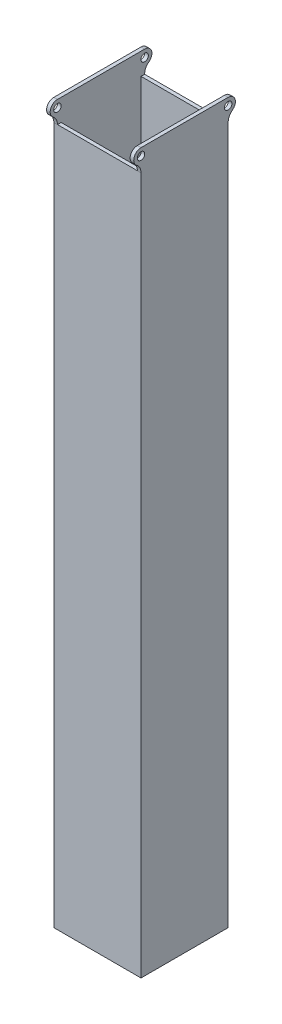
ISO-10303-21;
HEADER;
FILE_DESCRIPTION(('STEP AP214'),'2;1');
FILE_NAME('part.step','',(''),(''),'','','');
FILE_SCHEMA(('AUTOMOTIVE_DESIGN { 1 0 10303 214 1 1 1 1 }'));
ENDSEC;
DATA;
#1=APPLICATION_CONTEXT('core data for automotive mechanical design processes');
#2=APPLICATION_PROTOCOL_DEFINITION('international standard','automotive_design',2000,#1);
#3=PRODUCT_CONTEXT('',#1,'mechanical');
#4=PRODUCT('Part','Part','',(#3));
#5=PRODUCT_RELATED_PRODUCT_CATEGORY('part','',(#4));
#6=PRODUCT_DEFINITION_FORMATION('','',#4);
#7=PRODUCT_DEFINITION_CONTEXT('part definition',#1,'design');
#8=PRODUCT_DEFINITION('design','',#6,#7);
#9=PRODUCT_DEFINITION_SHAPE('','',#8);
#10=(LENGTH_UNIT() NAMED_UNIT(*) SI_UNIT(.MILLI.,.METRE.));
#11=(NAMED_UNIT(*) PLANE_ANGLE_UNIT() SI_UNIT($,.RADIAN.));
#12=(NAMED_UNIT(*) SI_UNIT($,.STERADIAN.) SOLID_ANGLE_UNIT());
#13=UNCERTAINTY_MEASURE_WITH_UNIT(LENGTH_MEASURE(1.E-05),#10,'distance_accuracy_value','');
#14=(GEOMETRIC_REPRESENTATION_CONTEXT(3) GLOBAL_UNCERTAINTY_ASSIGNED_CONTEXT((#13)) GLOBAL_UNIT_ASSIGNED_CONTEXT((#10,
#11,#12)) REPRESENTATION_CONTEXT('',''));
#15=CARTESIAN_POINT('',(0.,0.,0.));
#16=DIRECTION('',(0.,0.,1.));
#17=DIRECTION('',(1.,0.,0.));
#18=AXIS2_PLACEMENT_3D('',#15,#16,#17);
#19=CARTESIAN_POINT('',(0.,152.4,0.));
#20=DIRECTION('',(0.,-1.,0.));
#21=DIRECTION('',(0.,0.,-1.));
#22=AXIS2_PLACEMENT_3D('',#19,#20,#21);
#23=PLANE('',#22);
#24=DIRECTION('',(1.,0.,0.));
#25=VECTOR('',#24,1.);
#26=CARTESIAN_POINT('',(-19.05,152.4,19.05));
#27=LINE('',#26,#25);
#28=CARTESIAN_POINT('',(-17.4625,152.4,19.05));
#29=VERTEX_POINT('',#28);
#30=CARTESIAN_POINT('',(17.4625,152.4,19.05));
#31=VERTEX_POINT('',#30);
#32=EDGE_CURVE('E335',#29,#31,#27,.T.);
#33=ORIENTED_EDGE('',*,*,#32,.T.);
#34=DIRECTION('',(0.,0.,1.));
#35=VECTOR('',#34,1.);
#36=CARTESIAN_POINT('',(17.4625,152.4,19.05));
#37=LINE('',#36,#35);
#38=CARTESIAN_POINT('',(17.4625,152.4,17.4625));
#39=VERTEX_POINT('',#38);
#40=EDGE_CURVE('E253',#39,#31,#37,.T.);
#41=ORIENTED_EDGE('',*,*,#40,.F.);
#42=DIRECTION('',(1.,0.,0.));
#43=VECTOR('',#42,1.);
#44=CARTESIAN_POINT('',(0.,152.4,17.4625));
#45=LINE('',#44,#43);
#46=CARTESIAN_POINT('',(-17.4625,152.4,17.4625));
#47=VERTEX_POINT('',#46);
#48=EDGE_CURVE('E309',#47,#39,#45,.T.);
#49=ORIENTED_EDGE('',*,*,#48,.F.);
#50=DIRECTION('',(0.,0.,1.));
#51=VECTOR('',#50,1.);
#52=CARTESIAN_POINT('',(-17.4625,152.4,0.));
#53=LINE('',#52,#51);
#54=EDGE_CURVE('E12',#47,#29,#53,.T.);
#55=ORIENTED_EDGE('',*,*,#54,.T.);
#56=EDGE_LOOP('',(#33,#41,#49,#55));
#57=FACE_BOUND('',#56,.T.);
#58=ADVANCED_FACE('F86',(#57),#23,.F.);
#59=CARTESIAN_POINT('',(-19.05,152.4,19.05));
#60=DIRECTION('',(-1.,0.,0.));
#61=DIRECTION('',(0.,0.,1.));
#62=AXIS2_PLACEMENT_3D('',#59,#60,#61);
#63=PLANE('',#62);
#64=CARTESIAN_POINT('',(-19.05,158.75,-19.05));
#65=DIRECTION('',(-1.,0.,0.));
#66=DIRECTION('',(0.,0.,1.));
#67=AXIS2_PLACEMENT_3D('',#64,#65,#66);
#68=CIRCLE('',#67,1.63194999999999);
#69=CARTESIAN_POINT('',(-19.05,158.75,-17.41805));
#70=VERTEX_POINT('',#69);
#71=EDGE_CURVE('E700',#70,#70,#68,.T.);
#72=ORIENTED_EDGE('',*,*,#71,.F.);
#73=EDGE_LOOP('',(#72));
#74=FACE_BOUND('',#73,.T.);
#75=CARTESIAN_POINT('',(-19.05,158.75,19.05));
#76=DIRECTION('',(-1.,0.,0.));
#77=DIRECTION('',(0.,0.,1.));
#78=AXIS2_PLACEMENT_3D('',#75,#76,#77);
#79=CIRCLE('',#78,1.63194999999999);
#80=CARTESIAN_POINT('',(-19.05,158.75,20.68195));
#81=VERTEX_POINT('',#80);
#82=EDGE_CURVE('E704',#81,#81,#79,.T.);
#83=ORIENTED_EDGE('',*,*,#82,.F.);
#84=EDGE_LOOP('',(#83));
#85=FACE_BOUND('',#84,.T.);
#86=DIRECTION('',(0.,0.,-1.));
#87=VECTOR('',#86,1.);
#88=CARTESIAN_POINT('',(-19.05,-152.4,19.05));
#89=LINE('',#88,#87);
#90=CARTESIAN_POINT('',(-19.05,-152.4,19.05));
#91=VERTEX_POINT('',#90);
#92=CARTESIAN_POINT('',(-19.05,-152.4,-19.05));
#93=VERTEX_POINT('',#92);
#94=EDGE_CURVE('E325',#91,#93,#89,.T.);
#95=ORIENTED_EDGE('',*,*,#94,.F.);
#96=DIRECTION('',(0.,-1.,0.));
#97=VECTOR('',#96,1.);
#98=CARTESIAN_POINT('',(-19.05,152.4,19.05));
#99=LINE('',#98,#97);
#100=CARTESIAN_POINT('',(-19.05,152.4,19.05));
#101=VERTEX_POINT('',#100);
#102=EDGE_CURVE('E95',#101,#91,#99,.T.);
#103=ORIENTED_EDGE('',*,*,#102,.F.);
#104=CARTESIAN_POINT('',(-19.05,152.4,23.8125));
#105=DIRECTION('',(1.,0.,0.));
#106=DIRECTION('',(0.,0.,-1.));
#107=AXIS2_PLACEMENT_3D('',#104,#105,#106);
#108=CIRCLE('',#107,4.76249999999999);
#109=CARTESIAN_POINT('',(-19.05,156.21,20.955));
#110=VERTEX_POINT('',#109);
#111=EDGE_CURVE('E274',#101,#110,#108,.T.);
#112=ORIENTED_EDGE('',*,*,#111,.T.);
#113=CARTESIAN_POINT('',(-19.05,158.75,19.05));
#114=DIRECTION('',(1.,0.,0.));
#115=DIRECTION('',(0.,0.,-1.));
#116=AXIS2_PLACEMENT_3D('',#113,#114,#115);
#117=CIRCLE('',#116,3.175);
#118=CARTESIAN_POINT('',(-19.05,161.925,19.05));
#119=VERTEX_POINT('',#118);
#120=EDGE_CURVE('E287',#119,#110,#117,.T.);
#121=ORIENTED_EDGE('',*,*,#120,.F.);
#122=DIRECTION('',(0.,0.,-1.));
#123=VECTOR('',#122,1.);
#124=CARTESIAN_POINT('',(-19.05,161.925,0.));
#125=LINE('',#124,#123);
#126=CARTESIAN_POINT('',(-19.05,161.925,-19.05));
#127=VERTEX_POINT('',#126);
#128=EDGE_CURVE('E271',#119,#127,#125,.T.);
#129=ORIENTED_EDGE('',*,*,#128,.T.);
#130=CARTESIAN_POINT('',(-19.05,158.75,-19.05));
#131=DIRECTION('',(1.,0.,0.));
#132=DIRECTION('',(0.,0.,-1.));
#133=AXIS2_PLACEMENT_3D('',#130,#131,#132);
#134=CIRCLE('',#133,3.175);
#135=CARTESIAN_POINT('',(-19.05,156.21,-20.955));
#136=VERTEX_POINT('',#135);
#137=EDGE_CURVE('E281',#127,#136,#134,.F.);
#138=ORIENTED_EDGE('',*,*,#137,.T.);
#139=CARTESIAN_POINT('',(-19.05,152.4,-23.8125));
#140=DIRECTION('',(1.,0.,0.));
#141=DIRECTION('',(0.,0.,-1.));
#142=AXIS2_PLACEMENT_3D('',#139,#140,#141);
#143=CIRCLE('',#142,4.76249999999999);
#144=CARTESIAN_POINT('',(-19.05,152.4,-19.05));
#145=VERTEX_POINT('',#144);
#146=EDGE_CURVE('E278',#145,#136,#143,.F.);
#147=ORIENTED_EDGE('',*,*,#146,.F.);
#148=DIRECTION('',(0.,-1.,0.));
#149=VECTOR('',#148,1.);
#150=CARTESIAN_POINT('',(-19.05,152.4,-19.05));
#151=LINE('',#150,#149);
#152=EDGE_CURVE('E339',#145,#93,#151,.T.);
#153=ORIENTED_EDGE('',*,*,#152,.T.);
#154=EDGE_LOOP('',(#95,#103,#112,#121,#129,#138,#147,#153));
#155=FACE_BOUND('',#154,.T.);
#156=ADVANCED_FACE('F88',(#74,#85,#155),#63,.T.);
#157=CARTESIAN_POINT('',(-19.05,152.4,19.05));
#158=DIRECTION('',(0.,0.,-1.));
#159=DIRECTION('',(-1.,0.,0.));
#160=AXIS2_PLACEMENT_3D('',#157,#158,#159);
#161=PLANE('',#160);
#162=DIRECTION('',(1.,0.,0.));
#163=VECTOR('',#162,1.);
#164=CARTESIAN_POINT('',(-19.05,-152.4,19.05));
#165=LINE('',#164,#163);
#166=CARTESIAN_POINT('',(19.05,-152.4,19.05));
#167=VERTEX_POINT('',#166);
#168=EDGE_CURVE('E348',#91,#167,#165,.T.);
#169=ORIENTED_EDGE('',*,*,#168,.T.);
#170=DIRECTION('',(0.,-1.,0.));
#171=VECTOR('',#170,1.);
#172=CARTESIAN_POINT('',(19.05,152.4,19.05));
#173=LINE('',#172,#171);
#174=CARTESIAN_POINT('',(19.05,152.4,19.05));
#175=VERTEX_POINT('',#174);
#176=EDGE_CURVE('E351',#175,#167,#173,.T.);
#177=ORIENTED_EDGE('',*,*,#176,.F.);
#178=DIRECTION('',(1.,0.,0.));
#179=VECTOR('',#178,1.);
#180=CARTESIAN_POINT('',(17.4625,152.4,19.05));
#181=LINE('',#180,#179);
#182=EDGE_CURVE('E263',#31,#175,#181,.T.);
#183=ORIENTED_EDGE('',*,*,#182,.F.);
#184=ORIENTED_EDGE('',*,*,#32,.F.);
#185=EDGE_CURVE('E337',#101,#29,#27,.T.);
#186=ORIENTED_EDGE('',*,*,#185,.F.);
#187=ORIENTED_EDGE('',*,*,#102,.T.);
#188=EDGE_LOOP('',(#169,#177,#183,#184,#186,#187));
#189=FACE_BOUND('',#188,.T.);
#190=ADVANCED_FACE('F370',(#189),#161,.F.);
#191=CARTESIAN_POINT('',(19.05,152.4,19.05));
#192=DIRECTION('',(-1.,0.,0.));
#193=DIRECTION('',(0.,0.,1.));
#194=AXIS2_PLACEMENT_3D('',#191,#192,#193);
#195=PLANE('',#194);
#196=CARTESIAN_POINT('',(19.05,158.75,-19.05));
#197=DIRECTION('',(-1.,0.,0.));
#198=DIRECTION('',(0.,0.,1.));
#199=AXIS2_PLACEMENT_3D('',#196,#197,#198);
#200=CIRCLE('',#199,1.63194999999999);
#201=CARTESIAN_POINT('',(19.05,158.75,-17.41805));
#202=VERTEX_POINT('',#201);
#203=EDGE_CURVE('E710',#202,#202,#200,.T.);
#204=ORIENTED_EDGE('',*,*,#203,.T.);
#205=EDGE_LOOP('',(#204));
#206=FACE_BOUND('',#205,.T.);
#207=CARTESIAN_POINT('',(19.05,158.75,19.05));
#208=DIRECTION('',(-1.,0.,0.));
#209=DIRECTION('',(0.,0.,1.));
#210=AXIS2_PLACEMENT_3D('',#207,#208,#209);
#211=CIRCLE('',#210,1.63194999999999);
#212=CARTESIAN_POINT('',(19.05,158.75,20.68195));
#213=VERTEX_POINT('',#212);
#214=EDGE_CURVE('E707',#213,#213,#211,.T.);
#215=ORIENTED_EDGE('',*,*,#214,.T.);
#216=EDGE_LOOP('',(#215));
#217=FACE_BOUND('',#216,.T.);
#218=DIRECTION('',(0.,0.,-1.));
#219=VECTOR('',#218,1.);
#220=CARTESIAN_POINT('',(19.05,-152.4,19.05));
#221=LINE('',#220,#219);
#222=CARTESIAN_POINT('',(19.05,-152.4,-19.05));
#223=VERTEX_POINT('',#222);
#224=EDGE_CURVE('E345',#167,#223,#221,.T.);
#225=ORIENTED_EDGE('',*,*,#224,.T.);
#226=DIRECTION('',(0.,-1.,0.));
#227=VECTOR('',#226,1.);
#228=CARTESIAN_POINT('',(19.05,152.4,-19.05));
#229=LINE('',#228,#227);
#230=CARTESIAN_POINT('',(19.05,152.4,-19.05));
#231=VERTEX_POINT('',#230);
#232=EDGE_CURVE('E354',#231,#223,#229,.T.);
#233=ORIENTED_EDGE('',*,*,#232,.F.);
#234=CARTESIAN_POINT('',(19.05,152.4,-23.8125));
#235=DIRECTION('',(-1.,0.,0.));
#236=DIRECTION('',(0.,0.,1.));
#237=AXIS2_PLACEMENT_3D('',#234,#235,#236);
#238=CIRCLE('',#237,4.76249999999999);
#239=CARTESIAN_POINT('',(19.05,156.21,-20.955));
#240=VERTEX_POINT('',#239);
#241=EDGE_CURVE('E255',#231,#240,#238,.T.);
#242=ORIENTED_EDGE('',*,*,#241,.T.);
#243=CARTESIAN_POINT('',(19.05,158.75,-19.05));
#244=DIRECTION('',(-1.,0.,0.));
#245=DIRECTION('',(0.,0.,1.));
#246=AXIS2_PLACEMENT_3D('',#243,#244,#245);
#247=CIRCLE('',#246,3.175);
#248=CARTESIAN_POINT('',(19.05,161.925,-19.05));
#249=VERTEX_POINT('',#248);
#250=EDGE_CURVE('E230',#249,#240,#247,.T.);
#251=ORIENTED_EDGE('',*,*,#250,.F.);
#252=DIRECTION('',(0.,0.,-1.));
#253=VECTOR('',#252,1.);
#254=CARTESIAN_POINT('',(19.05,161.925,19.05));
#255=LINE('',#254,#253);
#256=CARTESIAN_POINT('',(19.05,161.925,19.05));
#257=VERTEX_POINT('',#256);
#258=EDGE_CURVE('E258',#257,#249,#255,.T.);
#259=ORIENTED_EDGE('',*,*,#258,.F.);
#260=CARTESIAN_POINT('',(19.05,158.75,19.05));
#261=DIRECTION('',(-1.,0.,0.));
#262=DIRECTION('',(0.,0.,1.));
#263=AXIS2_PLACEMENT_3D('',#260,#261,#262);
#264=CIRCLE('',#263,3.175);
#265=CARTESIAN_POINT('',(19.05,156.21,20.955));
#266=VERTEX_POINT('',#265);
#267=EDGE_CURVE('E241',#266,#257,#264,.T.);
#268=ORIENTED_EDGE('',*,*,#267,.F.);
#269=CARTESIAN_POINT('',(19.05,152.4,23.8125));
#270=DIRECTION('',(-1.,0.,0.));
#271=DIRECTION('',(0.,0.,1.));
#272=AXIS2_PLACEMENT_3D('',#269,#270,#271);
#273=CIRCLE('',#272,4.76249999999999);
#274=EDGE_CURVE('E238',#266,#175,#273,.T.);
#275=ORIENTED_EDGE('',*,*,#274,.T.);
#276=ORIENTED_EDGE('',*,*,#176,.T.);
#277=EDGE_LOOP('',(#225,#233,#242,#251,#259,#268,#275,#276));
#278=FACE_BOUND('',#277,.T.);
#279=ADVANCED_FACE('F374',(#206,#217,#278),#195,.F.);
#280=CARTESIAN_POINT('',(-19.05,152.4,-19.05));
#281=DIRECTION('',(0.,0.,-1.));
#282=DIRECTION('',(-1.,0.,0.));
#283=AXIS2_PLACEMENT_3D('',#280,#281,#282);
#284=PLANE('',#283);
#285=DIRECTION('',(1.,0.,0.));
#286=VECTOR('',#285,1.);
#287=CARTESIAN_POINT('',(-19.05,-152.4,-19.05));
#288=LINE('',#287,#286);
#289=EDGE_CURVE('E342',#93,#223,#288,.T.);
#290=ORIENTED_EDGE('',*,*,#289,.F.);
#291=ORIENTED_EDGE('',*,*,#152,.F.);
#292=DIRECTION('',(1.,0.,0.));
#293=VECTOR('',#292,1.);
#294=CARTESIAN_POINT('',(-19.05,152.4,-19.05));
#295=LINE('',#294,#293);
#296=CARTESIAN_POINT('',(-17.4625,152.4,-19.05));
#297=VERTEX_POINT('',#296);
#298=EDGE_CURVE('E332',#145,#297,#295,.T.);
#299=ORIENTED_EDGE('',*,*,#298,.T.);
#300=CARTESIAN_POINT('',(17.4625,152.4,-19.05));
#301=VERTEX_POINT('',#300);
#302=EDGE_CURVE('E336',#297,#301,#295,.T.);
#303=ORIENTED_EDGE('',*,*,#302,.T.);
#304=DIRECTION('',(1.,0.,0.));
#305=VECTOR('',#304,1.);
#306=CARTESIAN_POINT('',(17.4625,152.4,-19.05));
#307=LINE('',#306,#305);
#308=EDGE_CURVE('E237',#301,#231,#307,.T.);
#309=ORIENTED_EDGE('',*,*,#308,.T.);
#310=ORIENTED_EDGE('',*,*,#232,.T.);
#311=EDGE_LOOP('',(#290,#291,#299,#303,#309,#310));
#312=FACE_BOUND('',#311,.T.);
#313=ADVANCED_FACE('F362',(#312),#284,.T.);
#314=DIRECTION('',(1.,0.,0.));
#315=VECTOR('',#314,1.);
#316=CARTESIAN_POINT('',(0.,152.4,-17.4625));
#317=LINE('',#316,#315);
#318=CARTESIAN_POINT('',(-17.4625,152.4,-17.4625));
#319=VERTEX_POINT('',#318);
#320=CARTESIAN_POINT('',(17.4625,152.4,-17.4625));
#321=VERTEX_POINT('',#320);
#322=EDGE_CURVE('E306',#319,#321,#317,.T.);
#323=ORIENTED_EDGE('',*,*,#322,.T.);
#324=EDGE_CURVE('E112',#301,#321,#37,.T.);
#325=ORIENTED_EDGE('',*,*,#324,.F.);
#326=ORIENTED_EDGE('',*,*,#302,.F.);
#327=EDGE_CURVE('E97',#297,#319,#53,.T.);
#328=ORIENTED_EDGE('',*,*,#327,.T.);
#329=EDGE_LOOP('',(#323,#325,#326,#328));
#330=FACE_BOUND('',#329,.T.);
#331=ADVANCED_FACE('F400',(#330),#23,.F.);
#332=CARTESIAN_POINT('',(0.,-152.4,0.));
#333=DIRECTION('',(0.,-1.,0.));
#334=DIRECTION('',(0.,0.,-1.));
#335=AXIS2_PLACEMENT_3D('',#332,#333,#334);
#336=PLANE('',#335);
#337=DIRECTION('',(0.,0.,-1.));
#338=VECTOR('',#337,1.);
#339=CARTESIAN_POINT('',(-17.4625,-152.4,0.));
#340=LINE('',#339,#338);
#341=CARTESIAN_POINT('',(-17.4625,-152.4,17.4625));
#342=VERTEX_POINT('',#341);
#343=CARTESIAN_POINT('',(-17.4625,-152.4,-17.4625));
#344=VERTEX_POINT('',#343);
#345=EDGE_CURVE('E297',#342,#344,#340,.T.);
#346=ORIENTED_EDGE('',*,*,#345,.F.);
#347=DIRECTION('',(1.,0.,0.));
#348=VECTOR('',#347,1.);
#349=CARTESIAN_POINT('',(0.,-152.4,17.4625));
#350=LINE('',#349,#348);
#351=CARTESIAN_POINT('',(17.4625,-152.4,17.4625));
#352=VERTEX_POINT('',#351);
#353=EDGE_CURVE('E310',#342,#352,#350,.T.);
#354=ORIENTED_EDGE('',*,*,#353,.T.);
#355=DIRECTION('',(0.,0.,-1.));
#356=VECTOR('',#355,1.);
#357=CARTESIAN_POINT('',(17.4625,-152.4,0.));
#358=LINE('',#357,#356);
#359=CARTESIAN_POINT('',(17.4625,-152.4,-17.4625));
#360=VERTEX_POINT('',#359);
#361=EDGE_CURVE('E318',#352,#360,#358,.T.);
#362=ORIENTED_EDGE('',*,*,#361,.T.);
#363=DIRECTION('',(1.,0.,0.));
#364=VECTOR('',#363,1.);
#365=CARTESIAN_POINT('',(0.,-152.4,-17.4625));
#366=LINE('',#365,#364);
#367=EDGE_CURVE('E315',#344,#360,#366,.T.);
#368=ORIENTED_EDGE('',*,*,#367,.F.);
#369=EDGE_LOOP('',(#346,#354,#362,#368));
#370=FACE_BOUND('',#369,.T.);
#371=ORIENTED_EDGE('',*,*,#94,.T.);
#372=ORIENTED_EDGE('',*,*,#289,.T.);
#373=ORIENTED_EDGE('',*,*,#224,.F.);
#374=ORIENTED_EDGE('',*,*,#168,.F.);
#375=EDGE_LOOP('',(#371,#372,#373,#374));
#376=FACE_BOUND('',#375,.T.);
#377=ADVANCED_FACE('F367',(#370,#376),#336,.T.);
#378=CARTESIAN_POINT('',(-17.4625,152.4,0.));
#379=DIRECTION('',(-1.,0.,0.));
#380=DIRECTION('',(0.,0.,1.));
#381=AXIS2_PLACEMENT_3D('',#378,#379,#380);
#382=PLANE('',#381);
#383=CARTESIAN_POINT('',(-17.4625,158.75,-19.05));
#384=DIRECTION('',(-1.,0.,0.));
#385=DIRECTION('',(0.,0.,1.));
#386=AXIS2_PLACEMENT_3D('',#383,#384,#385);
#387=CIRCLE('',#386,1.63194999999999);
#388=CARTESIAN_POINT('',(-17.4625,158.75,-17.41805));
#389=VERTEX_POINT('',#388);
#390=EDGE_CURVE('E703',#389,#389,#387,.T.);
#391=ORIENTED_EDGE('',*,*,#390,.T.);
#392=EDGE_LOOP('',(#391));
#393=FACE_BOUND('',#392,.T.);
#394=CARTESIAN_POINT('',(-17.4625,158.75,19.05));
#395=DIRECTION('',(-1.,0.,0.));
#396=DIRECTION('',(0.,0.,1.));
#397=AXIS2_PLACEMENT_3D('',#394,#395,#396);
#398=CIRCLE('',#397,1.63194999999999);
#399=CARTESIAN_POINT('',(-17.4625,158.75,20.68195));
#400=VERTEX_POINT('',#399);
#401=EDGE_CURVE('E244',#400,#400,#398,.T.);
#402=ORIENTED_EDGE('',*,*,#401,.T.);
#403=EDGE_LOOP('',(#402));
#404=FACE_BOUND('',#403,.T.);
#405=ORIENTED_EDGE('',*,*,#345,.T.);
#406=DIRECTION('',(0.,-1.,0.));
#407=VECTOR('',#406,1.);
#408=CARTESIAN_POINT('',(-17.4625,152.4,-17.4625));
#409=LINE('',#408,#407);
#410=EDGE_CURVE('E313',#319,#344,#409,.T.);
#411=ORIENTED_EDGE('',*,*,#410,.F.);
#412=ORIENTED_EDGE('',*,*,#327,.F.);
#413=CARTESIAN_POINT('',(-17.4625,152.4,-23.8125));
#414=DIRECTION('',(1.,0.,0.));
#415=DIRECTION('',(0.,0.,-1.));
#416=AXIS2_PLACEMENT_3D('',#413,#414,#415);
#417=CIRCLE('',#416,4.76249999999999);
#418=CARTESIAN_POINT('',(-17.4625,156.21,-20.955));
#419=VERTEX_POINT('',#418);
#420=EDGE_CURVE('E289',#297,#419,#417,.F.);
#421=ORIENTED_EDGE('',*,*,#420,.T.);
#422=CARTESIAN_POINT('',(-17.4625,158.75,-19.05));
#423=DIRECTION('',(1.,0.,0.));
#424=DIRECTION('',(0.,0.,-1.));
#425=AXIS2_PLACEMENT_3D('',#422,#423,#424);
#426=CIRCLE('',#425,3.175);
#427=CARTESIAN_POINT('',(-17.4625,161.925,-19.05));
#428=VERTEX_POINT('',#427);
#429=EDGE_CURVE('E275',#428,#419,#426,.F.);
#430=ORIENTED_EDGE('',*,*,#429,.F.);
#431=DIRECTION('',(0.,0.,-1.));
#432=VECTOR('',#431,1.);
#433=CARTESIAN_POINT('',(-17.4625,161.925,0.));
#434=LINE('',#433,#432);
#435=CARTESIAN_POINT('',(-17.4625,161.925,19.05));
#436=VERTEX_POINT('',#435);
#437=EDGE_CURVE('E284',#436,#428,#434,.T.);
#438=ORIENTED_EDGE('',*,*,#437,.F.);
#439=CARTESIAN_POINT('',(-17.4625,158.75,19.05));
#440=DIRECTION('',(1.,0.,0.));
#441=DIRECTION('',(0.,0.,-1.));
#442=AXIS2_PLACEMENT_3D('',#439,#440,#441);
#443=CIRCLE('',#442,3.175);
#444=CARTESIAN_POINT('',(-17.4625,156.21,20.955));
#445=VERTEX_POINT('',#444);
#446=EDGE_CURVE('E262',#436,#445,#443,.T.);
#447=ORIENTED_EDGE('',*,*,#446,.T.);
#448=CARTESIAN_POINT('',(-17.4625,152.4,23.8125));
#449=DIRECTION('',(1.,0.,0.));
#450=DIRECTION('',(0.,0.,-1.));
#451=AXIS2_PLACEMENT_3D('',#448,#449,#450);
#452=CIRCLE('',#451,4.76249999999999);
#453=EDGE_CURVE('E104',#29,#445,#452,.T.);
#454=ORIENTED_EDGE('',*,*,#453,.F.);
#455=ORIENTED_EDGE('',*,*,#54,.F.);
#456=DIRECTION('',(0.,-1.,0.));
#457=VECTOR('',#456,1.);
#458=CARTESIAN_POINT('',(-17.4625,152.4,17.4625));
#459=LINE('',#458,#457);
#460=EDGE_CURVE('E323',#47,#342,#459,.T.);
#461=ORIENTED_EDGE('',*,*,#460,.T.);
#462=EDGE_LOOP('',(#405,#411,#412,#421,#430,#438,#447,#454,#455,#461));
#463=FACE_BOUND('',#462,.T.);
#464=ADVANCED_FACE('F387',(#393,#404,#463),#382,.F.);
#465=CARTESIAN_POINT('',(0.,152.4,17.4625));
#466=DIRECTION('',(0.,0.,-1.));
#467=DIRECTION('',(-1.,0.,0.));
#468=AXIS2_PLACEMENT_3D('',#465,#466,#467);
#469=PLANE('',#468);
#470=ORIENTED_EDGE('',*,*,#353,.F.);
#471=ORIENTED_EDGE('',*,*,#460,.F.);
#472=ORIENTED_EDGE('',*,*,#48,.T.);
#473=DIRECTION('',(0.,-1.,0.));
#474=VECTOR('',#473,1.);
#475=CARTESIAN_POINT('',(17.4625,152.4,17.4625));
#476=LINE('',#475,#474);
#477=EDGE_CURVE('E326',#39,#352,#476,.T.);
#478=ORIENTED_EDGE('',*,*,#477,.T.);
#479=EDGE_LOOP('',(#470,#471,#472,#478));
#480=FACE_BOUND('',#479,.T.);
#481=ADVANCED_FACE('F390',(#480),#469,.T.);
#482=CARTESIAN_POINT('',(17.4625,152.4,0.));
#483=DIRECTION('',(-1.,0.,0.));
#484=DIRECTION('',(0.,0.,1.));
#485=AXIS2_PLACEMENT_3D('',#482,#483,#484);
#486=PLANE('',#485);
#487=CARTESIAN_POINT('',(17.4625,158.75,-19.05));
#488=DIRECTION('',(-1.,0.,0.));
#489=DIRECTION('',(0.,0.,1.));
#490=AXIS2_PLACEMENT_3D('',#487,#488,#489);
#491=CIRCLE('',#490,1.63194999999999);
#492=CARTESIAN_POINT('',(17.4625,158.75,-17.41805));
#493=VERTEX_POINT('',#492);
#494=EDGE_CURVE('E90',#493,#493,#491,.T.);
#495=ORIENTED_EDGE('',*,*,#494,.F.);
#496=EDGE_LOOP('',(#495));
#497=FACE_BOUND('',#496,.T.);
#498=CARTESIAN_POINT('',(17.4625,158.75,19.05));
#499=DIRECTION('',(-1.,0.,0.));
#500=DIRECTION('',(0.,0.,1.));
#501=AXIS2_PLACEMENT_3D('',#498,#499,#500);
#502=CIRCLE('',#501,1.63194999999999);
#503=CARTESIAN_POINT('',(17.4625,158.75,20.68195));
#504=VERTEX_POINT('',#503);
#505=EDGE_CURVE('E715',#504,#504,#502,.T.);
#506=ORIENTED_EDGE('',*,*,#505,.F.);
#507=EDGE_LOOP('',(#506));
#508=FACE_BOUND('',#507,.T.);
#509=ORIENTED_EDGE('',*,*,#361,.F.);
#510=ORIENTED_EDGE('',*,*,#477,.F.);
#511=ORIENTED_EDGE('',*,*,#40,.T.);
#512=CARTESIAN_POINT('',(17.4625,152.4,23.8125));
#513=DIRECTION('',(-1.,0.,0.));
#514=DIRECTION('',(0.,0.,1.));
#515=AXIS2_PLACEMENT_3D('',#512,#513,#514);
#516=CIRCLE('',#515,4.76249999999999);
#517=CARTESIAN_POINT('',(17.4625,156.21,20.955));
#518=VERTEX_POINT('',#517);
#519=EDGE_CURVE('E250',#518,#31,#516,.T.);
#520=ORIENTED_EDGE('',*,*,#519,.F.);
#521=CARTESIAN_POINT('',(17.4625,158.75,19.05));
#522=DIRECTION('',(-1.,0.,0.));
#523=DIRECTION('',(0.,0.,1.));
#524=AXIS2_PLACEMENT_3D('',#521,#522,#523);
#525=CIRCLE('',#524,3.175);
#526=CARTESIAN_POINT('',(17.4625,161.925,19.05));
#527=VERTEX_POINT('',#526);
#528=EDGE_CURVE('E248',#518,#527,#525,.T.);
#529=ORIENTED_EDGE('',*,*,#528,.T.);
#530=DIRECTION('',(0.,0.,-1.));
#531=VECTOR('',#530,1.);
#532=CARTESIAN_POINT('',(17.4625,161.925,19.05));
#533=LINE('',#532,#531);
#534=CARTESIAN_POINT('',(17.4625,161.925,-19.05));
#535=VERTEX_POINT('',#534);
#536=EDGE_CURVE('E221',#527,#535,#533,.T.);
#537=ORIENTED_EDGE('',*,*,#536,.T.);
#538=CARTESIAN_POINT('',(17.4625,158.75,-19.05));
#539=DIRECTION('',(-1.,0.,0.));
#540=DIRECTION('',(0.,0.,1.));
#541=AXIS2_PLACEMENT_3D('',#538,#539,#540);
#542=CIRCLE('',#541,3.175);
#543=CARTESIAN_POINT('',(17.4625,156.21,-20.955));
#544=VERTEX_POINT('',#543);
#545=EDGE_CURVE('E214',#535,#544,#542,.T.);
#546=ORIENTED_EDGE('',*,*,#545,.T.);
#547=CARTESIAN_POINT('',(17.4625,152.4,-23.8125));
#548=DIRECTION('',(-1.,0.,0.));
#549=DIRECTION('',(0.,0.,1.));
#550=AXIS2_PLACEMENT_3D('',#547,#548,#549);
#551=CIRCLE('',#550,4.76249999999999);
#552=EDGE_CURVE('E219',#301,#544,#551,.T.);
#553=ORIENTED_EDGE('',*,*,#552,.F.);
#554=ORIENTED_EDGE('',*,*,#324,.T.);
#555=DIRECTION('',(0.,-1.,0.));
#556=VECTOR('',#555,1.);
#557=CARTESIAN_POINT('',(17.4625,152.4,-17.4625));
#558=LINE('',#557,#556);
#559=EDGE_CURVE('E328',#321,#360,#558,.T.);
#560=ORIENTED_EDGE('',*,*,#559,.T.);
#561=EDGE_LOOP('',(#509,#510,#511,#520,#529,#537,#546,#553,#554,#560));
#562=FACE_BOUND('',#561,.T.);
#563=ADVANCED_FACE('F217',(#497,#508,#562),#486,.T.);
#564=CARTESIAN_POINT('',(0.,152.4,-17.4625));
#565=DIRECTION('',(0.,0.,-1.));
#566=DIRECTION('',(-1.,0.,0.));
#567=AXIS2_PLACEMENT_3D('',#564,#565,#566);
#568=PLANE('',#567);
#569=ORIENTED_EDGE('',*,*,#367,.T.);
#570=ORIENTED_EDGE('',*,*,#559,.F.);
#571=ORIENTED_EDGE('',*,*,#322,.F.);
#572=ORIENTED_EDGE('',*,*,#410,.T.);
#573=EDGE_LOOP('',(#569,#570,#571,#572));
#574=FACE_BOUND('',#573,.T.);
#575=ADVANCED_FACE('F398',(#574),#568,.F.);
#576=CARTESIAN_POINT('',(-19.05,161.925,0.));
#577=DIRECTION('',(0.,-1.,0.));
#578=DIRECTION('',(0.,0.,-1.));
#579=AXIS2_PLACEMENT_3D('',#576,#577,#578);
#580=PLANE('',#579);
#581=ORIENTED_EDGE('',*,*,#437,.T.);
#582=DIRECTION('',(1.,0.,0.));
#583=VECTOR('',#582,1.);
#584=CARTESIAN_POINT('',(-19.05,161.925,-19.05));
#585=LINE('',#584,#583);
#586=EDGE_CURVE('E294',#127,#428,#585,.T.);
#587=ORIENTED_EDGE('',*,*,#586,.F.);
#588=ORIENTED_EDGE('',*,*,#128,.F.);
#589=DIRECTION('',(1.,0.,0.));
#590=VECTOR('',#589,1.);
#591=CARTESIAN_POINT('',(-19.05,161.925,19.05));
#592=LINE('',#591,#590);
#593=EDGE_CURVE('E283',#119,#436,#592,.T.);
#594=ORIENTED_EDGE('',*,*,#593,.T.);
#595=EDGE_LOOP('',(#581,#587,#588,#594));
#596=FACE_BOUND('',#595,.T.);
#597=ADVANCED_FACE('F413',(#596),#580,.F.);
#598=CARTESIAN_POINT('',(-19.05,158.75,-19.05));
#599=DIRECTION('',(1.,0.,0.));
#600=DIRECTION('',(0.,0.,-1.));
#601=AXIS2_PLACEMENT_3D('',#598,#599,#600);
#602=CYLINDRICAL_SURFACE('',#601,3.175);
#603=ORIENTED_EDGE('',*,*,#429,.T.);
#604=DIRECTION('',(1.,0.,0.));
#605=VECTOR('',#604,1.);
#606=CARTESIAN_POINT('',(-19.05,156.21,-20.955));
#607=LINE('',#606,#605);
#608=EDGE_CURVE('E298',#136,#419,#607,.T.);
#609=ORIENTED_EDGE('',*,*,#608,.F.);
#610=ORIENTED_EDGE('',*,*,#137,.F.);
#611=ORIENTED_EDGE('',*,*,#586,.T.);
#612=EDGE_LOOP('',(#603,#609,#610,#611));
#613=FACE_BOUND('',#612,.T.);
#614=ADVANCED_FACE('F408',(#613),#602,.T.);
#615=CARTESIAN_POINT('',(-19.05,152.4,-23.8125));
#616=DIRECTION('',(1.,0.,0.));
#617=DIRECTION('',(0.,0.,-1.));
#618=AXIS2_PLACEMENT_3D('',#615,#616,#617);
#619=CYLINDRICAL_SURFACE('',#618,4.76249999999999);
#620=ORIENTED_EDGE('',*,*,#420,.F.);
#621=ORIENTED_EDGE('',*,*,#298,.F.);
#622=ORIENTED_EDGE('',*,*,#146,.T.);
#623=ORIENTED_EDGE('',*,*,#608,.T.);
#624=EDGE_LOOP('',(#620,#621,#622,#623));
#625=FACE_BOUND('',#624,.T.);
#626=ADVANCED_FACE('F405',(#625),#619,.F.);
#627=CARTESIAN_POINT('',(-19.05,152.4,23.8125));
#628=DIRECTION('',(1.,0.,0.));
#629=DIRECTION('',(0.,0.,-1.));
#630=AXIS2_PLACEMENT_3D('',#627,#628,#629);
#631=CYLINDRICAL_SURFACE('',#630,4.76249999999999);
#632=ORIENTED_EDGE('',*,*,#453,.T.);
#633=DIRECTION('',(1.,0.,0.));
#634=VECTOR('',#633,1.);
#635=CARTESIAN_POINT('',(-19.05,156.21,20.955));
#636=LINE('',#635,#634);
#637=EDGE_CURVE('E300',#110,#445,#636,.T.);
#638=ORIENTED_EDGE('',*,*,#637,.F.);
#639=ORIENTED_EDGE('',*,*,#111,.F.);
#640=ORIENTED_EDGE('',*,*,#185,.T.);
#641=EDGE_LOOP('',(#632,#638,#639,#640));
#642=FACE_BOUND('',#641,.T.);
#643=ADVANCED_FACE('F419',(#642),#631,.F.);
#644=CARTESIAN_POINT('',(-19.05,158.75,19.05));
#645=DIRECTION('',(1.,0.,0.));
#646=DIRECTION('',(0.,0.,-1.));
#647=AXIS2_PLACEMENT_3D('',#644,#645,#646);
#648=CYLINDRICAL_SURFACE('',#647,3.175);
#649=ORIENTED_EDGE('',*,*,#593,.F.);
#650=ORIENTED_EDGE('',*,*,#120,.T.);
#651=ORIENTED_EDGE('',*,*,#637,.T.);
#652=ORIENTED_EDGE('',*,*,#446,.F.);
#653=EDGE_LOOP('',(#649,#650,#651,#652));
#654=FACE_BOUND('',#653,.T.);
#655=ADVANCED_FACE('F417',(#654),#648,.T.);
#656=CARTESIAN_POINT('',(17.4625,152.4,-23.8125));
#657=DIRECTION('',(1.,0.,0.));
#658=DIRECTION('',(0.,0.,-1.));
#659=AXIS2_PLACEMENT_3D('',#656,#657,#658);
#660=CYLINDRICAL_SURFACE('',#659,4.76249999999999);
#661=ORIENTED_EDGE('',*,*,#241,.F.);
#662=ORIENTED_EDGE('',*,*,#308,.F.);
#663=ORIENTED_EDGE('',*,*,#552,.T.);
#664=DIRECTION('',(1.,0.,0.));
#665=VECTOR('',#664,1.);
#666=CARTESIAN_POINT('',(17.4625,156.21,-20.955));
#667=LINE('',#666,#665);
#668=EDGE_CURVE('E227',#544,#240,#667,.T.);
#669=ORIENTED_EDGE('',*,*,#668,.T.);
#670=EDGE_LOOP('',(#661,#662,#663,#669));
#671=FACE_BOUND('',#670,.T.);
#672=ADVANCED_FACE('F235',(#671),#660,.F.);
#673=CARTESIAN_POINT('',(17.4625,152.4,23.8125));
#674=DIRECTION('',(1.,0.,0.));
#675=DIRECTION('',(0.,0.,-1.));
#676=AXIS2_PLACEMENT_3D('',#673,#674,#675);
#677=CYLINDRICAL_SURFACE('',#676,4.76249999999999);
#678=ORIENTED_EDGE('',*,*,#274,.F.);
#679=DIRECTION('',(1.,0.,0.));
#680=VECTOR('',#679,1.);
#681=CARTESIAN_POINT('',(17.4625,156.21,20.955));
#682=LINE('',#681,#680);
#683=EDGE_CURVE('E265',#518,#266,#682,.T.);
#684=ORIENTED_EDGE('',*,*,#683,.F.);
#685=ORIENTED_EDGE('',*,*,#519,.T.);
#686=ORIENTED_EDGE('',*,*,#182,.T.);
#687=EDGE_LOOP('',(#678,#684,#685,#686));
#688=FACE_BOUND('',#687,.T.);
#689=ADVANCED_FACE('F379',(#688),#677,.F.);
#690=CARTESIAN_POINT('',(17.4625,158.75,19.05));
#691=DIRECTION('',(1.,0.,0.));
#692=DIRECTION('',(0.,0.,-1.));
#693=AXIS2_PLACEMENT_3D('',#690,#691,#692);
#694=CYLINDRICAL_SURFACE('',#693,3.175);
#695=ORIENTED_EDGE('',*,*,#267,.T.);
#696=DIRECTION('',(1.,0.,0.));
#697=VECTOR('',#696,1.);
#698=CARTESIAN_POINT('',(17.4625,161.925,19.05));
#699=LINE('',#698,#697);
#700=EDGE_CURVE('E267',#527,#257,#699,.T.);
#701=ORIENTED_EDGE('',*,*,#700,.F.);
#702=ORIENTED_EDGE('',*,*,#528,.F.);
#703=ORIENTED_EDGE('',*,*,#683,.T.);
#704=EDGE_LOOP('',(#695,#701,#702,#703));
#705=FACE_BOUND('',#704,.T.);
#706=ADVANCED_FACE('F536',(#705),#694,.T.);
#707=CARTESIAN_POINT('',(17.4625,161.925,19.05));
#708=DIRECTION('',(0.,-1.,0.));
#709=DIRECTION('',(0.,0.,-1.));
#710=AXIS2_PLACEMENT_3D('',#707,#708,#709);
#711=PLANE('',#710);
#712=ORIENTED_EDGE('',*,*,#258,.T.);
#713=DIRECTION('',(1.,0.,0.));
#714=VECTOR('',#713,1.);
#715=CARTESIAN_POINT('',(17.4625,161.925,-19.05));
#716=LINE('',#715,#714);
#717=EDGE_CURVE('E233',#535,#249,#716,.T.);
#718=ORIENTED_EDGE('',*,*,#717,.F.);
#719=ORIENTED_EDGE('',*,*,#536,.F.);
#720=ORIENTED_EDGE('',*,*,#700,.T.);
#721=EDGE_LOOP('',(#712,#718,#719,#720));
#722=FACE_BOUND('',#721,.T.);
#723=ADVANCED_FACE('F539',(#722),#711,.F.);
#724=CARTESIAN_POINT('',(17.4625,158.75,-19.05));
#725=DIRECTION('',(1.,0.,0.));
#726=DIRECTION('',(0.,0.,-1.));
#727=AXIS2_PLACEMENT_3D('',#724,#725,#726);
#728=CYLINDRICAL_SURFACE('',#727,3.175);
#729=ORIENTED_EDGE('',*,*,#250,.T.);
#730=ORIENTED_EDGE('',*,*,#668,.F.);
#731=ORIENTED_EDGE('',*,*,#545,.F.);
#732=ORIENTED_EDGE('',*,*,#717,.T.);
#733=EDGE_LOOP('',(#729,#730,#731,#732));
#734=FACE_BOUND('',#733,.T.);
#735=ADVANCED_FACE('F228',(#734),#728,.T.);
#736=CARTESIAN_POINT('',(-19.05,158.75,19.05));
#737=DIRECTION('',(-1.,0.,0.));
#738=DIRECTION('',(0.,0.,1.));
#739=AXIS2_PLACEMENT_3D('',#736,#737,#738);
#740=CYLINDRICAL_SURFACE('',#739,1.63194999999999);
#741=ORIENTED_EDGE('',*,*,#82,.T.);
#742=EDGE_LOOP('',(#741));
#743=FACE_BOUND('',#742,.T.);
#744=ORIENTED_EDGE('',*,*,#401,.F.);
#745=EDGE_LOOP('',(#744));
#746=FACE_BOUND('',#745,.T.);
#747=ADVANCED_FACE('F492',(#743,#746),#740,.F.);
#748=ORIENTED_EDGE('',*,*,#505,.T.);
#749=EDGE_LOOP('',(#748));
#750=FACE_BOUND('',#749,.T.);
#751=ORIENTED_EDGE('',*,*,#214,.F.);
#752=EDGE_LOOP('',(#751));
#753=FACE_BOUND('',#752,.T.);
#754=ADVANCED_FACE('F497',(#750,#753),#740,.F.);
#755=CARTESIAN_POINT('',(-19.05,158.75,-19.05));
#756=DIRECTION('',(-1.,0.,0.));
#757=DIRECTION('',(0.,0.,1.));
#758=AXIS2_PLACEMENT_3D('',#755,#756,#757);
#759=CYLINDRICAL_SURFACE('',#758,1.63194999999999);
#760=ORIENTED_EDGE('',*,*,#494,.T.);
#761=EDGE_LOOP('',(#760));
#762=FACE_BOUND('',#761,.T.);
#763=ORIENTED_EDGE('',*,*,#203,.F.);
#764=EDGE_LOOP('',(#763));
#765=FACE_BOUND('',#764,.T.);
#766=ADVANCED_FACE('F509',(#762,#765),#759,.F.);
#767=ORIENTED_EDGE('',*,*,#71,.T.);
#768=EDGE_LOOP('',(#767));
#769=FACE_BOUND('',#768,.T.);
#770=ORIENTED_EDGE('',*,*,#390,.F.);
#771=EDGE_LOOP('',(#770));
#772=FACE_BOUND('',#771,.T.);
#773=ADVANCED_FACE('F518',(#769,#772),#759,.F.);
#774=CLOSED_SHELL('',(#58,#156,#190,#279,#313,#331,#377,#464,#481,#563,#575,#597,#614,#626,#643,
#655,#672,#689,#706,#723,#735,#747,#754,#766,#773));
#775=MANIFOLD_SOLID_BREP('B2',#774);
#776=ADVANCED_BREP_SHAPE_REPRESENTATION('',(#18,#775),#14);
#777=SHAPE_DEFINITION_REPRESENTATION(#9,#776);
ENDSEC;
END-ISO-10303-21;
